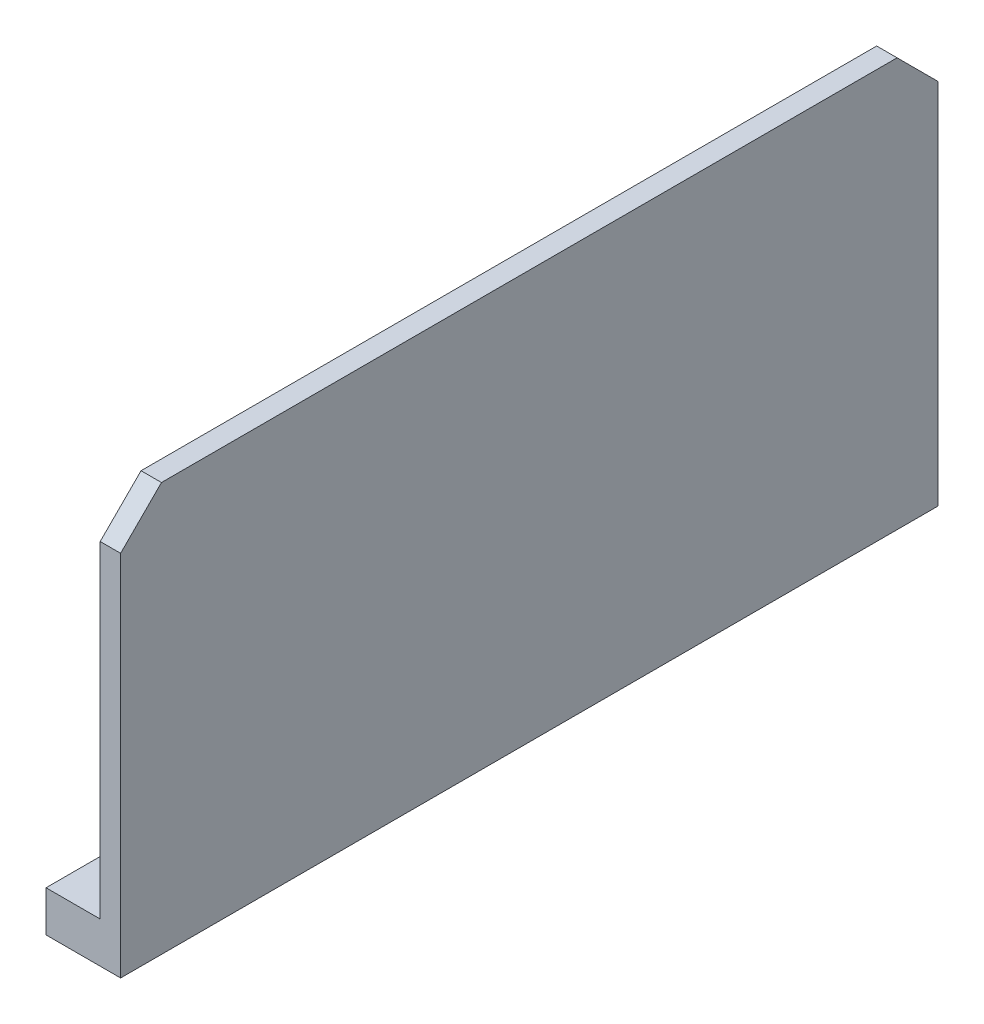
ISO-10303-21;
HEADER;
FILE_DESCRIPTION(('STEP AP214'),'2;1');
FILE_NAME('part.step','',(''),(''),'','','');
FILE_SCHEMA(('AUTOMOTIVE_DESIGN { 1 0 10303 214 1 1 1 1 }'));
ENDSEC;
DATA;
#1=APPLICATION_CONTEXT('core data for automotive mechanical design processes');
#2=APPLICATION_PROTOCOL_DEFINITION('international standard','automotive_design',2000,#1);
#3=PRODUCT_CONTEXT('',#1,'mechanical');
#4=PRODUCT('Part','Part','',(#3));
#5=PRODUCT_RELATED_PRODUCT_CATEGORY('part','',(#4));
#6=PRODUCT_DEFINITION_FORMATION('','',#4);
#7=PRODUCT_DEFINITION_CONTEXT('part definition',#1,'design');
#8=PRODUCT_DEFINITION('design','',#6,#7);
#9=PRODUCT_DEFINITION_SHAPE('','',#8);
#10=(LENGTH_UNIT() NAMED_UNIT(*) SI_UNIT(.MILLI.,.METRE.));
#11=(NAMED_UNIT(*) PLANE_ANGLE_UNIT() SI_UNIT($,.RADIAN.));
#12=(NAMED_UNIT(*) SI_UNIT($,.STERADIAN.) SOLID_ANGLE_UNIT());
#13=UNCERTAINTY_MEASURE_WITH_UNIT(LENGTH_MEASURE(1.E-05),#10,'distance_accuracy_value','');
#14=(GEOMETRIC_REPRESENTATION_CONTEXT(3) GLOBAL_UNCERTAINTY_ASSIGNED_CONTEXT((#13)) GLOBAL_UNIT_ASSIGNED_CONTEXT((#10,
#11,#12)) REPRESENTATION_CONTEXT('',''));
#15=CARTESIAN_POINT('',(0.,0.,0.));
#16=DIRECTION('',(0.,0.,1.));
#17=DIRECTION('',(1.,0.,0.));
#18=AXIS2_PLACEMENT_3D('',#15,#16,#17);
#19=CARTESIAN_POINT('',(0.,4.,0.));
#20=DIRECTION('',(0.,1.,0.));
#21=DIRECTION('',(0.,0.,1.));
#22=AXIS2_PLACEMENT_3D('',#19,#20,#21);
#23=PLANE('',#22);
#24=CARTESIAN_POINT('',(0.,4.,-35.));
#25=DIRECTION('',(0.,1.,0.));
#26=DIRECTION('',(0.,0.,1.));
#27=AXIS2_PLACEMENT_3D('',#24,#25,#26);
#28=CIRCLE('',#27,1.5);
#29=CARTESIAN_POINT('',(0.,4.,-33.5));
#30=VERTEX_POINT('',#29);
#31=EDGE_CURVE('E244',#30,#30,#28,.T.);
#32=ORIENTED_EDGE('',*,*,#31,.F.);
#33=EDGE_LOOP('',(#32));
#34=FACE_BOUND('',#33,.T.);
#35=DIRECTION('',(0.,0.,1.));
#36=VECTOR('',#35,1.);
#37=CARTESIAN_POINT('',(-2.4,4.,0.));
#38=LINE('',#37,#36);
#39=CARTESIAN_POINT('',(-2.4,4.,-40.));
#40=VERTEX_POINT('',#39);
#41=CARTESIAN_POINT('',(-2.4,4.,-1.));
#42=VERTEX_POINT('',#41);
#43=EDGE_CURVE('E238',#40,#42,#38,.T.);
#44=ORIENTED_EDGE('',*,*,#43,.T.);
#45=DIRECTION('',(1.,0.,0.));
#46=VECTOR('',#45,1.);
#47=CARTESIAN_POINT('',(0.,4.,-1.));
#48=LINE('',#47,#46);
#49=CARTESIAN_POINT('',(2.89999999999999,4.,-1.));
#50=VERTEX_POINT('',#49);
#51=EDGE_CURVE('E207',#42,#50,#48,.T.);
#52=ORIENTED_EDGE('',*,*,#51,.T.);
#53=DIRECTION('',(0.,0.,-1.));
#54=VECTOR('',#53,1.);
#55=CARTESIAN_POINT('',(2.89999999999999,4.,0.));
#56=LINE('',#55,#54);
#57=CARTESIAN_POINT('',(2.89999999999999,4.,-40.));
#58=VERTEX_POINT('',#57);
#59=EDGE_CURVE('E225',#50,#58,#56,.T.);
#60=ORIENTED_EDGE('',*,*,#59,.T.);
#61=DIRECTION('',(1.,0.,0.));
#62=VECTOR('',#61,1.);
#63=CARTESIAN_POINT('',(0.,4.,-40.));
#64=LINE('',#63,#62);
#65=EDGE_CURVE('E233',#40,#58,#64,.T.);
#66=ORIENTED_EDGE('',*,*,#65,.F.);
#67=EDGE_LOOP('',(#44,#52,#60,#66));
#68=FACE_BOUND('',#67,.T.);
#69=ADVANCED_FACE('F64',(#34,#68),#23,.T.);
#70=CARTESIAN_POINT('',(-2.4,4.,0.));
#71=DIRECTION('',(1.,0.,0.));
#72=DIRECTION('',(0.,0.,-1.));
#73=AXIS2_PLACEMENT_3D('',#70,#71,#72);
#74=PLANE('',#73);
#75=DIRECTION('',(0.,-1.,0.));
#76=VECTOR('',#75,1.);
#77=CARTESIAN_POINT('',(-2.4,4.,-1.));
#78=LINE('',#77,#76);
#79=CARTESIAN_POINT('',(-2.4,0.,-1.));
#80=VERTEX_POINT('',#79);
#81=EDGE_CURVE('E177',#42,#80,#78,.T.);
#82=ORIENTED_EDGE('',*,*,#81,.F.);
#83=ORIENTED_EDGE('',*,*,#43,.F.);
#84=DIRECTION('',(0.,-1.,0.));
#85=VECTOR('',#84,1.);
#86=CARTESIAN_POINT('',(-2.4,4.,-40.));
#87=LINE('',#86,#85);
#88=CARTESIAN_POINT('',(-2.4,0.,-40.));
#89=VERTEX_POINT('',#88);
#90=EDGE_CURVE('E271',#40,#89,#87,.T.);
#91=ORIENTED_EDGE('',*,*,#90,.T.);
#92=DIRECTION('',(0.,0.,1.));
#93=VECTOR('',#92,1.);
#94=CARTESIAN_POINT('',(-2.4,0.,0.));
#95=LINE('',#94,#93);
#96=EDGE_CURVE('E254',#89,#80,#95,.T.);
#97=ORIENTED_EDGE('',*,*,#96,.T.);
#98=EDGE_LOOP('',(#82,#83,#91,#97));
#99=FACE_BOUND('',#98,.T.);
#100=ADVANCED_FACE('F306',(#99),#74,.F.);
#101=CARTESIAN_POINT('',(2.89999999999999,40.,0.));
#102=DIRECTION('',(1.,0.,0.));
#103=DIRECTION('',(0.,0.,-1.));
#104=AXIS2_PLACEMENT_3D('',#101,#102,#103);
#105=PLANE('',#104);
#106=DIRECTION('',(0.,0.,1.));
#107=VECTOR('',#106,1.);
#108=CARTESIAN_POINT('',(2.89999999999999,40.,0.));
#109=LINE('',#108,#107);
#110=CARTESIAN_POINT('',(2.89999999999998,40.,-36.));
#111=VERTEX_POINT('',#110);
#112=CARTESIAN_POINT('',(2.89999999999999,40.,-1.));
#113=VERTEX_POINT('',#112);
#114=EDGE_CURVE('E219',#111,#113,#109,.T.);
#115=ORIENTED_EDGE('',*,*,#114,.F.);
#116=DIRECTION('',(0.,0.707106781186546,0.707106781186549));
#117=VECTOR('',#116,1.);
#118=CARTESIAN_POINT('',(2.89999999999998,36.,-40.));
#119=LINE('',#118,#117);
#120=CARTESIAN_POINT('',(2.89999999999998,36.,-40.));
#121=VERTEX_POINT('',#120);
#122=EDGE_CURVE('E12',#111,#121,#119,.F.);
#123=ORIENTED_EDGE('',*,*,#122,.T.);
#124=DIRECTION('',(0.,-1.,0.));
#125=VECTOR('',#124,1.);
#126=CARTESIAN_POINT('',(2.89999999999998,40.,-40.));
#127=LINE('',#126,#125);
#128=EDGE_CURVE('E223',#121,#58,#127,.T.);
#129=ORIENTED_EDGE('',*,*,#128,.T.);
#130=ORIENTED_EDGE('',*,*,#59,.F.);
#131=DIRECTION('',(0.,-1.,0.));
#132=VECTOR('',#131,1.);
#133=CARTESIAN_POINT('',(2.9,0.,-1.));
#134=LINE('',#133,#132);
#135=EDGE_CURVE('E193',#113,#50,#134,.T.);
#136=ORIENTED_EDGE('',*,*,#135,.F.);
#137=EDGE_LOOP('',(#115,#123,#129,#130,#136));
#138=FACE_BOUND('',#137,.T.);
#139=ADVANCED_FACE('F311',(#138),#105,.F.);
#140=DIRECTION('',(1.,0.,0.));
#141=VECTOR('',#140,1.);
#142=CARTESIAN_POINT('',(0.,4.,1.));
#143=LINE('',#142,#141);
#144=CARTESIAN_POINT('',(-2.4,4.,1.));
#145=VERTEX_POINT('',#144);
#146=CARTESIAN_POINT('',(2.89999999999999,4.,1.));
#147=VERTEX_POINT('',#146);
#148=EDGE_CURVE('E213',#145,#147,#143,.T.);
#149=ORIENTED_EDGE('',*,*,#148,.F.);
#150=CARTESIAN_POINT('',(-2.4,4.,40.));
#151=VERTEX_POINT('',#150);
#152=EDGE_CURVE('E237',#145,#151,#38,.T.);
#153=ORIENTED_EDGE('',*,*,#152,.T.);
#154=DIRECTION('',(1.,0.,0.));
#155=VECTOR('',#154,1.);
#156=CARTESIAN_POINT('',(0.,4.,40.));
#157=LINE('',#156,#155);
#158=CARTESIAN_POINT('',(2.89999999999999,4.,40.));
#159=VERTEX_POINT('',#158);
#160=EDGE_CURVE('E241',#151,#159,#157,.T.);
#161=ORIENTED_EDGE('',*,*,#160,.T.);
#162=EDGE_CURVE('E226',#159,#147,#56,.T.);
#163=ORIENTED_EDGE('',*,*,#162,.T.);
#164=EDGE_LOOP('',(#149,#153,#161,#163));
#165=FACE_BOUND('',#164,.T.);
#166=CARTESIAN_POINT('',(0.,4.,35.));
#167=DIRECTION('',(0.,1.,0.));
#168=DIRECTION('',(0.,0.,1.));
#169=AXIS2_PLACEMENT_3D('',#166,#167,#168);
#170=CIRCLE('',#169,1.5);
#171=CARTESIAN_POINT('',(0.,4.,36.5));
#172=VERTEX_POINT('',#171);
#173=EDGE_CURVE('E230',#172,#172,#170,.T.);
#174=ORIENTED_EDGE('',*,*,#173,.F.);
#175=EDGE_LOOP('',(#174));
#176=FACE_BOUND('',#175,.T.);
#177=ADVANCED_FACE('F321',(#165,#176),#23,.T.);
#178=CARTESIAN_POINT('',(0.,4.,-40.));
#179=DIRECTION('',(0.,0.,-1.));
#180=DIRECTION('',(-1.,0.,0.));
#181=AXIS2_PLACEMENT_3D('',#178,#179,#180);
#182=PLANE('',#181);
#183=ORIENTED_EDGE('',*,*,#128,.F.);
#184=DIRECTION('',(1.,0.,0.));
#185=VECTOR('',#184,1.);
#186=CARTESIAN_POINT('',(0.,36.,-40.));
#187=LINE('',#186,#185);
#188=CARTESIAN_POINT('',(4.9,36.,-40.));
#189=VERTEX_POINT('',#188);
#190=EDGE_CURVE('E73',#121,#189,#187,.T.);
#191=ORIENTED_EDGE('',*,*,#190,.T.);
#192=DIRECTION('',(0.,-1.,0.));
#193=VECTOR('',#192,1.);
#194=CARTESIAN_POINT('',(4.9,4.,-40.));
#195=LINE('',#194,#193);
#196=CARTESIAN_POINT('',(4.9,0.,-40.));
#197=VERTEX_POINT('',#196);
#198=EDGE_CURVE('E247',#189,#197,#195,.T.);
#199=ORIENTED_EDGE('',*,*,#198,.T.);
#200=DIRECTION('',(1.,0.,0.));
#201=VECTOR('',#200,1.);
#202=CARTESIAN_POINT('',(0.,0.,-40.));
#203=LINE('',#202,#201);
#204=EDGE_CURVE('E250',#89,#197,#203,.T.);
#205=ORIENTED_EDGE('',*,*,#204,.F.);
#206=ORIENTED_EDGE('',*,*,#90,.F.);
#207=ORIENTED_EDGE('',*,*,#65,.T.);
#208=EDGE_LOOP('',(#183,#191,#199,#205,#206,#207));
#209=FACE_BOUND('',#208,.T.);
#210=ADVANCED_FACE('F288',(#209),#182,.T.);
#211=ORIENTED_EDGE('',*,*,#152,.F.);
#212=DIRECTION('',(0.,-1.,0.));
#213=VECTOR('',#212,1.);
#214=CARTESIAN_POINT('',(-2.4,4.,1.));
#215=LINE('',#214,#213);
#216=CARTESIAN_POINT('',(-2.4,0.,1.));
#217=VERTEX_POINT('',#216);
#218=EDGE_CURVE('E210',#145,#217,#215,.T.);
#219=ORIENTED_EDGE('',*,*,#218,.T.);
#220=CARTESIAN_POINT('',(-2.4,0.,40.));
#221=VERTEX_POINT('',#220);
#222=EDGE_CURVE('E253',#217,#221,#95,.T.);
#223=ORIENTED_EDGE('',*,*,#222,.T.);
#224=DIRECTION('',(0.,-1.,0.));
#225=VECTOR('',#224,1.);
#226=CARTESIAN_POINT('',(-2.4,4.,40.));
#227=LINE('',#226,#225);
#228=EDGE_CURVE('E268',#151,#221,#227,.T.);
#229=ORIENTED_EDGE('',*,*,#228,.F.);
#230=EDGE_LOOP('',(#211,#219,#223,#229));
#231=FACE_BOUND('',#230,.T.);
#232=ADVANCED_FACE('F317',(#231),#74,.F.);
#233=CARTESIAN_POINT('',(0.,4.,40.));
#234=DIRECTION('',(0.,0.,-1.));
#235=DIRECTION('',(-1.,0.,0.));
#236=AXIS2_PLACEMENT_3D('',#233,#234,#235);
#237=PLANE('',#236);
#238=DIRECTION('',(0.,-1.,0.));
#239=VECTOR('',#238,1.);
#240=CARTESIAN_POINT('',(4.9,4.,40.));
#241=LINE('',#240,#239);
#242=CARTESIAN_POINT('',(4.9,36.,40.));
#243=VERTEX_POINT('',#242);
#244=CARTESIAN_POINT('',(4.9,0.,40.));
#245=VERTEX_POINT('',#244);
#246=EDGE_CURVE('E266',#243,#245,#241,.T.);
#247=ORIENTED_EDGE('',*,*,#246,.F.);
#248=DIRECTION('',(-1.,0.,0.));
#249=VECTOR('',#248,1.);
#250=CARTESIAN_POINT('',(2.89999999999999,36.,40.));
#251=LINE('',#250,#249);
#252=CARTESIAN_POINT('',(2.89999999999999,36.,40.));
#253=VERTEX_POINT('',#252);
#254=EDGE_CURVE('E86',#243,#253,#251,.T.);
#255=ORIENTED_EDGE('',*,*,#254,.T.);
#256=DIRECTION('',(0.,-1.,0.));
#257=VECTOR('',#256,1.);
#258=CARTESIAN_POINT('',(2.89999999999999,40.,40.));
#259=LINE('',#258,#257);
#260=EDGE_CURVE('E221',#253,#159,#259,.T.);
#261=ORIENTED_EDGE('',*,*,#260,.T.);
#262=ORIENTED_EDGE('',*,*,#160,.F.);
#263=ORIENTED_EDGE('',*,*,#228,.T.);
#264=DIRECTION('',(1.,0.,0.));
#265=VECTOR('',#264,1.);
#266=CARTESIAN_POINT('',(0.,0.,40.));
#267=LINE('',#266,#265);
#268=EDGE_CURVE('E257',#221,#245,#267,.T.);
#269=ORIENTED_EDGE('',*,*,#268,.T.);
#270=EDGE_LOOP('',(#247,#255,#261,#262,#263,#269));
#271=FACE_BOUND('',#270,.T.);
#272=ADVANCED_FACE('F323',(#271),#237,.F.);
#273=CARTESIAN_POINT('',(4.9,4.,0.));
#274=DIRECTION('',(-1.,0.,0.));
#275=DIRECTION('',(0.,0.,1.));
#276=AXIS2_PLACEMENT_3D('',#273,#274,#275);
#277=PLANE('',#276);
#278=DIRECTION('',(0.,0.,-1.));
#279=VECTOR('',#278,1.);
#280=CARTESIAN_POINT('',(4.9,40.,0.));
#281=LINE('',#280,#279);
#282=CARTESIAN_POINT('',(4.9,40.,36.));
#283=VERTEX_POINT('',#282);
#284=CARTESIAN_POINT('',(4.9,40.,-36.));
#285=VERTEX_POINT('',#284);
#286=EDGE_CURVE('E215',#283,#285,#281,.T.);
#287=ORIENTED_EDGE('',*,*,#286,.F.);
#288=DIRECTION('',(0.,-0.707106781186548,0.707106781186547));
#289=VECTOR('',#288,1.);
#290=CARTESIAN_POINT('',(4.9,40.,36.));
#291=LINE('',#290,#289);
#292=EDGE_CURVE('E280',#283,#243,#291,.T.);
#293=ORIENTED_EDGE('',*,*,#292,.T.);
#294=ORIENTED_EDGE('',*,*,#246,.T.);
#295=DIRECTION('',(0.,0.,-1.));
#296=VECTOR('',#295,1.);
#297=CARTESIAN_POINT('',(4.9,0.,0.));
#298=LINE('',#297,#296);
#299=EDGE_CURVE('E260',#245,#197,#298,.T.);
#300=ORIENTED_EDGE('',*,*,#299,.T.);
#301=ORIENTED_EDGE('',*,*,#198,.F.);
#302=DIRECTION('',(0.,-0.707106781186546,-0.707106781186549));
#303=VECTOR('',#302,1.);
#304=CARTESIAN_POINT('',(4.9,36.,-40.));
#305=LINE('',#304,#303);
#306=EDGE_CURVE('E278',#189,#285,#305,.F.);
#307=ORIENTED_EDGE('',*,*,#306,.T.);
#308=EDGE_LOOP('',(#287,#293,#294,#300,#301,#307));
#309=FACE_BOUND('',#308,.T.);
#310=ADVANCED_FACE('F293',(#309),#277,.F.);
#311=CARTESIAN_POINT('',(0.,4.,35.));
#312=DIRECTION('',(0.,-1.,0.));
#313=DIRECTION('',(0.,0.,-1.));
#314=AXIS2_PLACEMENT_3D('',#311,#312,#313);
#315=CYLINDRICAL_SURFACE('',#314,1.5);
#316=ORIENTED_EDGE('',*,*,#173,.T.);
#317=EDGE_LOOP('',(#316));
#318=FACE_BOUND('',#317,.T.);
#319=CARTESIAN_POINT('',(0.,0.,35.));
#320=DIRECTION('',(0.,1.,0.));
#321=DIRECTION('',(0.,0.,1.));
#322=AXIS2_PLACEMENT_3D('',#319,#320,#321);
#323=CIRCLE('',#322,1.5);
#324=CARTESIAN_POINT('',(0.,0.,36.5));
#325=VERTEX_POINT('',#324);
#326=EDGE_CURVE('E229',#325,#325,#323,.T.);
#327=ORIENTED_EDGE('',*,*,#326,.F.);
#328=EDGE_LOOP('',(#327));
#329=FACE_BOUND('',#328,.T.);
#330=ADVANCED_FACE('F368',(#318,#329),#315,.F.);
#331=CARTESIAN_POINT('',(0.,4.,-35.));
#332=DIRECTION('',(0.,-1.,0.));
#333=DIRECTION('',(0.,0.,-1.));
#334=AXIS2_PLACEMENT_3D('',#331,#332,#333);
#335=CYLINDRICAL_SURFACE('',#334,1.5);
#336=ORIENTED_EDGE('',*,*,#31,.T.);
#337=EDGE_LOOP('',(#336));
#338=FACE_BOUND('',#337,.T.);
#339=CARTESIAN_POINT('',(0.,0.,-35.));
#340=DIRECTION('',(0.,1.,0.));
#341=DIRECTION('',(0.,0.,1.));
#342=AXIS2_PLACEMENT_3D('',#339,#340,#341);
#343=CIRCLE('',#342,1.5);
#344=CARTESIAN_POINT('',(0.,0.,-33.5));
#345=VERTEX_POINT('',#344);
#346=EDGE_CURVE('E234',#345,#345,#343,.T.);
#347=ORIENTED_EDGE('',*,*,#346,.F.);
#348=EDGE_LOOP('',(#347));
#349=FACE_BOUND('',#348,.T.);
#350=ADVANCED_FACE('F364',(#338,#349),#335,.F.);
#351=CARTESIAN_POINT('',(0.,0.,0.));
#352=DIRECTION('',(0.,1.,0.));
#353=DIRECTION('',(0.,0.,1.));
#354=AXIS2_PLACEMENT_3D('',#351,#352,#353);
#355=PLANE('',#354);
#356=ORIENTED_EDGE('',*,*,#222,.F.);
#357=DIRECTION('',(-1.,0.,0.));
#358=VECTOR('',#357,1.);
#359=CARTESIAN_POINT('',(0.,0.,1.));
#360=LINE('',#359,#358);
#361=CARTESIAN_POINT('',(-7.1,0.,1.));
#362=VERTEX_POINT('',#361);
#363=EDGE_CURVE('E192',#217,#362,#360,.T.);
#364=ORIENTED_EDGE('',*,*,#363,.T.);
#365=DIRECTION('',(0.,0.,-1.));
#366=VECTOR('',#365,1.);
#367=CARTESIAN_POINT('',(-7.1,0.,1.));
#368=LINE('',#367,#366);
#369=CARTESIAN_POINT('',(-7.1,0.,-1.));
#370=VERTEX_POINT('',#369);
#371=EDGE_CURVE('E178',#362,#370,#368,.T.);
#372=ORIENTED_EDGE('',*,*,#371,.T.);
#373=DIRECTION('',(-1.,0.,0.));
#374=VECTOR('',#373,1.);
#375=CARTESIAN_POINT('',(0.,0.,-1.));
#376=LINE('',#375,#374);
#377=EDGE_CURVE('E196',#80,#370,#376,.T.);
#378=ORIENTED_EDGE('',*,*,#377,.F.);
#379=ORIENTED_EDGE('',*,*,#96,.F.);
#380=ORIENTED_EDGE('',*,*,#204,.T.);
#381=ORIENTED_EDGE('',*,*,#299,.F.);
#382=ORIENTED_EDGE('',*,*,#268,.F.);
#383=EDGE_LOOP('',(#356,#364,#372,#378,#379,#380,#381,#382));
#384=FACE_BOUND('',#383,.T.);
#385=ORIENTED_EDGE('',*,*,#346,.T.);
#386=EDGE_LOOP('',(#385));
#387=FACE_BOUND('',#386,.T.);
#388=ORIENTED_EDGE('',*,*,#326,.T.);
#389=EDGE_LOOP('',(#388));
#390=FACE_BOUND('',#389,.T.);
#391=ADVANCED_FACE('F298',(#384,#387,#390),#355,.F.);
#392=ORIENTED_EDGE('',*,*,#260,.F.);
#393=DIRECTION('',(0.,0.707106781186548,-0.707106781186547));
#394=VECTOR('',#393,1.);
#395=CARTESIAN_POINT('',(2.89999999999999,40.,36.));
#396=LINE('',#395,#394);
#397=CARTESIAN_POINT('',(2.89999999999999,40.,36.));
#398=VERTEX_POINT('',#397);
#399=EDGE_CURVE('E283',#253,#398,#396,.T.);
#400=ORIENTED_EDGE('',*,*,#399,.T.);
#401=CARTESIAN_POINT('',(2.89999999999999,40.,1.));
#402=VERTEX_POINT('',#401);
#403=EDGE_CURVE('E218',#402,#398,#109,.T.);
#404=ORIENTED_EDGE('',*,*,#403,.F.);
#405=DIRECTION('',(0.,-1.,0.));
#406=VECTOR('',#405,1.);
#407=CARTESIAN_POINT('',(2.9,0.,1.));
#408=LINE('',#407,#406);
#409=EDGE_CURVE('E186',#402,#147,#408,.T.);
#410=ORIENTED_EDGE('',*,*,#409,.T.);
#411=ORIENTED_EDGE('',*,*,#162,.F.);
#412=EDGE_LOOP('',(#392,#400,#404,#410,#411));
#413=FACE_BOUND('',#412,.T.);
#414=ADVANCED_FACE('F327',(#413),#105,.F.);
#415=CARTESIAN_POINT('',(0.,40.,0.));
#416=DIRECTION('',(0.,1.,0.));
#417=DIRECTION('',(0.,0.,1.));
#418=AXIS2_PLACEMENT_3D('',#415,#416,#417);
#419=PLANE('',#418);
#420=ORIENTED_EDGE('',*,*,#403,.T.);
#421=DIRECTION('',(1.,0.,0.));
#422=VECTOR('',#421,1.);
#423=CARTESIAN_POINT('',(4.9,40.,36.));
#424=LINE('',#423,#422);
#425=EDGE_CURVE('E275',#398,#283,#424,.T.);
#426=ORIENTED_EDGE('',*,*,#425,.T.);
#427=ORIENTED_EDGE('',*,*,#286,.T.);
#428=DIRECTION('',(-1.,0.,0.));
#429=VECTOR('',#428,1.);
#430=CARTESIAN_POINT('',(0.,40.,-36.));
#431=LINE('',#430,#429);
#432=EDGE_CURVE('E273',#285,#111,#431,.T.);
#433=ORIENTED_EDGE('',*,*,#432,.T.);
#434=ORIENTED_EDGE('',*,*,#114,.T.);
#435=DIRECTION('',(0.,0.,-1.));
#436=VECTOR('',#435,1.);
#437=CARTESIAN_POINT('',(2.89999999999999,40.,1.));
#438=LINE('',#437,#436);
#439=EDGE_CURVE('E188',#402,#113,#438,.T.);
#440=ORIENTED_EDGE('',*,*,#439,.F.);
#441=EDGE_LOOP('',(#420,#426,#427,#433,#434,#440));
#442=FACE_BOUND('',#441,.T.);
#443=ADVANCED_FACE('F332',(#442),#419,.T.);
#444=CARTESIAN_POINT('',(-7.1,0.,1.));
#445=DIRECTION('',(1.,0.,0.));
#446=DIRECTION('',(0.,1.,0.));
#447=AXIS2_PLACEMENT_3D('',#444,#445,#446);
#448=PLANE('',#447);
#449=DIRECTION('',(0.,-1.,0.));
#450=VECTOR('',#449,1.);
#451=CARTESIAN_POINT('',(-7.1,0.,-1.));
#452=LINE('',#451,#450);
#453=CARTESIAN_POINT('',(-7.1,4.,-1.));
#454=VERTEX_POINT('',#453);
#455=EDGE_CURVE('E200',#454,#370,#452,.T.);
#456=ORIENTED_EDGE('',*,*,#455,.T.);
#457=ORIENTED_EDGE('',*,*,#371,.F.);
#458=DIRECTION('',(0.,-1.,0.));
#459=VECTOR('',#458,1.);
#460=CARTESIAN_POINT('',(-7.1,0.,1.));
#461=LINE('',#460,#459);
#462=CARTESIAN_POINT('',(-7.1,4.,1.));
#463=VERTEX_POINT('',#462);
#464=EDGE_CURVE('E183',#463,#362,#461,.T.);
#465=ORIENTED_EDGE('',*,*,#464,.F.);
#466=DIRECTION('',(0.,0.,-1.));
#467=VECTOR('',#466,1.);
#468=CARTESIAN_POINT('',(-7.1,4.,1.));
#469=LINE('',#468,#467);
#470=EDGE_CURVE('E165',#463,#454,#469,.T.);
#471=ORIENTED_EDGE('',*,*,#470,.T.);
#472=EDGE_LOOP('',(#456,#457,#465,#471));
#473=FACE_BOUND('',#472,.T.);
#474=ADVANCED_FACE('F190',(#473),#448,.F.);
#475=CARTESIAN_POINT('',(0.,0.,1.));
#476=DIRECTION('',(0.,0.,1.));
#477=DIRECTION('',(1.,0.,0.));
#478=AXIS2_PLACEMENT_3D('',#475,#476,#477);
#479=PLANE('',#478);
#480=ORIENTED_EDGE('',*,*,#218,.F.);
#481=ORIENTED_EDGE('',*,*,#148,.T.);
#482=ORIENTED_EDGE('',*,*,#409,.F.);
#483=DIRECTION('',(0.267643863786095,0.963517909629941,0.));
#484=VECTOR('',#483,1.);
#485=CARTESIAN_POINT('',(-7.1,4.,1.));
#486=LINE('',#485,#484);
#487=EDGE_CURVE('E169',#463,#402,#486,.T.);
#488=ORIENTED_EDGE('',*,*,#487,.F.);
#489=ORIENTED_EDGE('',*,*,#464,.T.);
#490=ORIENTED_EDGE('',*,*,#363,.F.);
#491=EDGE_LOOP('',(#480,#481,#482,#488,#489,#490));
#492=FACE_BOUND('',#491,.T.);
#493=ADVANCED_FACE('F182',(#492),#479,.T.);
#494=CARTESIAN_POINT('',(0.,0.,-1.));
#495=DIRECTION('',(0.,0.,1.));
#496=DIRECTION('',(1.,0.,0.));
#497=AXIS2_PLACEMENT_3D('',#494,#495,#496);
#498=PLANE('',#497);
#499=ORIENTED_EDGE('',*,*,#51,.F.);
#500=ORIENTED_EDGE('',*,*,#81,.T.);
#501=ORIENTED_EDGE('',*,*,#377,.T.);
#502=ORIENTED_EDGE('',*,*,#455,.F.);
#503=DIRECTION('',(0.267643863786095,0.963517909629941,0.));
#504=VECTOR('',#503,1.);
#505=CARTESIAN_POINT('',(-7.1,4.,-1.));
#506=LINE('',#505,#504);
#507=EDGE_CURVE('E172',#454,#113,#506,.T.);
#508=ORIENTED_EDGE('',*,*,#507,.T.);
#509=ORIENTED_EDGE('',*,*,#135,.T.);
#510=EDGE_LOOP('',(#499,#500,#501,#502,#508,#509));
#511=FACE_BOUND('',#510,.T.);
#512=ADVANCED_FACE('F313',(#511),#498,.F.);
#513=CARTESIAN_POINT('',(-7.1,4.,1.));
#514=DIRECTION('',(-0.963517909629941,0.267643863786095,0.));
#515=DIRECTION('',(-0.267643863786095,-0.963517909629941,0.));
#516=AXIS2_PLACEMENT_3D('',#513,#514,#515);
#517=PLANE('',#516);
#518=ORIENTED_EDGE('',*,*,#507,.F.);
#519=ORIENTED_EDGE('',*,*,#470,.F.);
#520=ORIENTED_EDGE('',*,*,#487,.T.);
#521=ORIENTED_EDGE('',*,*,#439,.T.);
#522=EDGE_LOOP('',(#518,#519,#520,#521));
#523=FACE_BOUND('',#522,.T.);
#524=ADVANCED_FACE('F167',(#523),#517,.T.);
#525=CARTESIAN_POINT('',(0.,40.,36.));
#526=DIRECTION('',(0.,0.707106781186547,0.707106781186548));
#527=DIRECTION('',(-1.,0.,0.));
#528=AXIS2_PLACEMENT_3D('',#525,#526,#527);
#529=PLANE('',#528);
#530=ORIENTED_EDGE('',*,*,#399,.F.);
#531=ORIENTED_EDGE('',*,*,#254,.F.);
#532=ORIENTED_EDGE('',*,*,#292,.F.);
#533=ORIENTED_EDGE('',*,*,#425,.F.);
#534=EDGE_LOOP('',(#530,#531,#532,#533));
#535=FACE_BOUND('',#534,.T.);
#536=ADVANCED_FACE('F335',(#535),#529,.T.);
#537=CARTESIAN_POINT('',(0.,36.,-40.));
#538=DIRECTION('',(0.,-0.707106781186549,0.707106781186546));
#539=DIRECTION('',(1.,0.,0.));
#540=AXIS2_PLACEMENT_3D('',#537,#538,#539);
#541=PLANE('',#540);
#542=ORIENTED_EDGE('',*,*,#122,.F.);
#543=ORIENTED_EDGE('',*,*,#432,.F.);
#544=ORIENTED_EDGE('',*,*,#306,.F.);
#545=ORIENTED_EDGE('',*,*,#190,.F.);
#546=EDGE_LOOP('',(#542,#543,#544,#545));
#547=FACE_BOUND('',#546,.T.);
#548=ADVANCED_FACE('F67',(#547),#541,.F.);
#549=CLOSED_SHELL('',(#69,#100,#139,#177,#210,#232,#272,#310,#330,#350,#391,#414,#443,#474,#493,
#512,#524,#536,#548));
#550=MANIFOLD_SOLID_BREP('B2',#549);
#551=ADVANCED_BREP_SHAPE_REPRESENTATION('',(#18,#550),#14);
#552=SHAPE_DEFINITION_REPRESENTATION(#9,#551);
ENDSEC;
END-ISO-10303-21;
